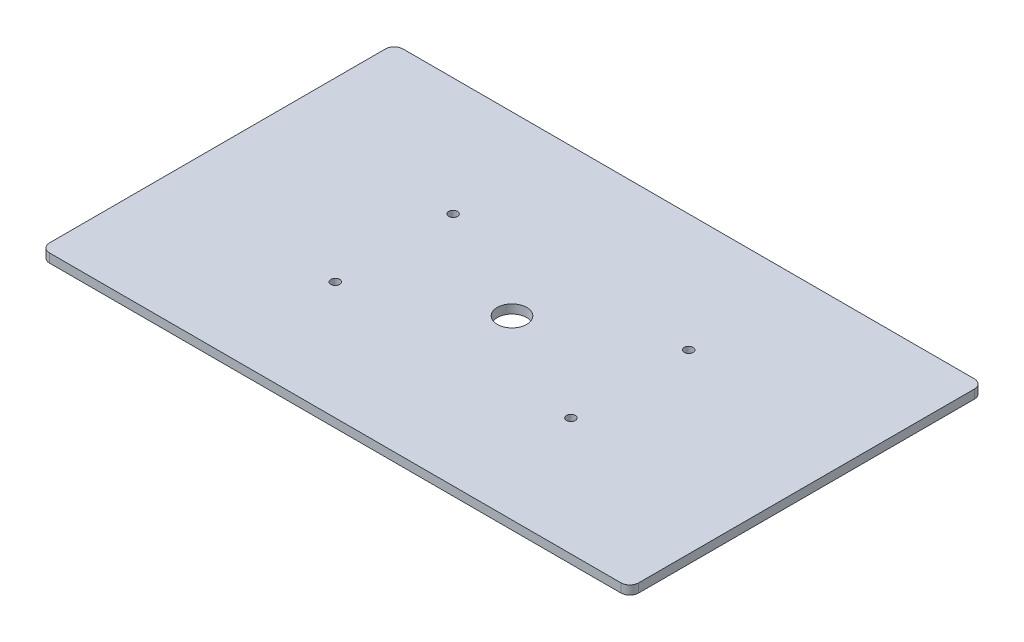
ISO-10303-21;
HEADER;
FILE_DESCRIPTION(('STEP AP214'),'2;1');
FILE_NAME('part.step','',(''),(''),'','','');
FILE_SCHEMA(('AUTOMOTIVE_DESIGN { 1 0 10303 214 1 1 1 1 }'));
ENDSEC;
DATA;
#1=APPLICATION_CONTEXT('core data for automotive mechanical design processes');
#2=APPLICATION_PROTOCOL_DEFINITION('international standard','automotive_design',2000,#1);
#3=PRODUCT_CONTEXT('',#1,'mechanical');
#4=PRODUCT('Part','Part','',(#3));
#5=PRODUCT_RELATED_PRODUCT_CATEGORY('part','',(#4));
#6=PRODUCT_DEFINITION_FORMATION('','',#4);
#7=PRODUCT_DEFINITION_CONTEXT('part definition',#1,'design');
#8=PRODUCT_DEFINITION('design','',#6,#7);
#9=PRODUCT_DEFINITION_SHAPE('','',#8);
#10=(LENGTH_UNIT() NAMED_UNIT(*) SI_UNIT(.MILLI.,.METRE.));
#11=(NAMED_UNIT(*) PLANE_ANGLE_UNIT() SI_UNIT($,.RADIAN.));
#12=(NAMED_UNIT(*) SI_UNIT($,.STERADIAN.) SOLID_ANGLE_UNIT());
#13=UNCERTAINTY_MEASURE_WITH_UNIT(LENGTH_MEASURE(1.E-05),#10,'distance_accuracy_value','');
#14=(GEOMETRIC_REPRESENTATION_CONTEXT(3) GLOBAL_UNCERTAINTY_ASSIGNED_CONTEXT((#13)) GLOBAL_UNIT_ASSIGNED_CONTEXT((#10,
#11,#12)) REPRESENTATION_CONTEXT('',''));
#15=CARTESIAN_POINT('',(0.,0.,0.));
#16=DIRECTION('',(0.,0.,1.));
#17=DIRECTION('',(1.,0.,0.));
#18=AXIS2_PLACEMENT_3D('',#15,#16,#17);
#19=CARTESIAN_POINT('',(100.,3.,-60.));
#20=DIRECTION('',(-1.,0.,0.));
#21=DIRECTION('',(0.,0.,1.));
#22=AXIS2_PLACEMENT_3D('',#19,#20,#21);
#23=PLANE('',#22);
#24=DIRECTION('',(0.,0.,-1.));
#25=VECTOR('',#24,1.);
#26=CARTESIAN_POINT('',(100.,0.,-60.));
#27=LINE('',#26,#25);
#28=CARTESIAN_POINT('',(100.,0.,57.));
#29=VERTEX_POINT('',#28);
#30=CARTESIAN_POINT('',(100.,0.,-57.));
#31=VERTEX_POINT('',#30);
#32=EDGE_CURVE('E144',#29,#31,#27,.T.);
#33=ORIENTED_EDGE('',*,*,#32,.T.);
#34=DIRECTION('',(0.,-1.,0.));
#35=VECTOR('',#34,1.);
#36=CARTESIAN_POINT('',(100.,3.,-57.));
#37=LINE('',#36,#35);
#38=CARTESIAN_POINT('',(100.,3.,-57.));
#39=VERTEX_POINT('',#38);
#40=EDGE_CURVE('E11',#31,#39,#37,.F.);
#41=ORIENTED_EDGE('',*,*,#40,.T.);
#42=DIRECTION('',(0.,0.,-1.));
#43=VECTOR('',#42,1.);
#44=CARTESIAN_POINT('',(100.,3.,-60.));
#45=LINE('',#44,#43);
#46=CARTESIAN_POINT('',(100.,3.,57.));
#47=VERTEX_POINT('',#46);
#48=EDGE_CURVE('E142',#47,#39,#45,.T.);
#49=ORIENTED_EDGE('',*,*,#48,.F.);
#50=DIRECTION('',(0.,-1.,0.));
#51=VECTOR('',#50,1.);
#52=CARTESIAN_POINT('',(100.,3.,57.));
#53=LINE('',#52,#51);
#54=EDGE_CURVE('E51',#47,#29,#53,.T.);
#55=ORIENTED_EDGE('',*,*,#54,.T.);
#56=EDGE_LOOP('',(#33,#41,#49,#55));
#57=FACE_BOUND('',#56,.T.);
#58=ADVANCED_FACE('F42',(#57),#23,.F.);
#59=CARTESIAN_POINT('',(-100.,3.,-60.));
#60=DIRECTION('',(0.,0.,1.));
#61=DIRECTION('',(1.,0.,0.));
#62=AXIS2_PLACEMENT_3D('',#59,#60,#61);
#63=PLANE('',#62);
#64=DIRECTION('',(-1.,0.,0.));
#65=VECTOR('',#64,1.);
#66=CARTESIAN_POINT('',(-100.,0.,-60.));
#67=LINE('',#66,#65);
#68=CARTESIAN_POINT('',(97.,0.,-60.));
#69=VERTEX_POINT('',#68);
#70=CARTESIAN_POINT('',(-97.,0.,-60.));
#71=VERTEX_POINT('',#70);
#72=EDGE_CURVE('E138',#69,#71,#67,.T.);
#73=ORIENTED_EDGE('',*,*,#72,.T.);
#74=DIRECTION('',(0.,-1.,0.));
#75=VECTOR('',#74,1.);
#76=CARTESIAN_POINT('',(-97.,3.,-60.));
#77=LINE('',#76,#75);
#78=CARTESIAN_POINT('',(-97.,3.,-60.));
#79=VERTEX_POINT('',#78);
#80=EDGE_CURVE('E114',#71,#79,#77,.F.);
#81=ORIENTED_EDGE('',*,*,#80,.T.);
#82=DIRECTION('',(-1.,0.,0.));
#83=VECTOR('',#82,1.);
#84=CARTESIAN_POINT('',(-100.,3.,-60.));
#85=LINE('',#84,#83);
#86=CARTESIAN_POINT('',(97.,3.,-60.));
#87=VERTEX_POINT('',#86);
#88=EDGE_CURVE('E201',#87,#79,#85,.T.);
#89=ORIENTED_EDGE('',*,*,#88,.F.);
#90=DIRECTION('',(0.,-1.,0.));
#91=VECTOR('',#90,1.);
#92=CARTESIAN_POINT('',(97.,3.,-60.));
#93=LINE('',#92,#91);
#94=EDGE_CURVE('E120',#87,#69,#93,.T.);
#95=ORIENTED_EDGE('',*,*,#94,.T.);
#96=EDGE_LOOP('',(#73,#81,#89,#95));
#97=FACE_BOUND('',#96,.T.);
#98=ADVANCED_FACE('F268',(#97),#63,.F.);
#99=CARTESIAN_POINT('',(-100.,3.,-60.));
#100=DIRECTION('',(1.,0.,0.));
#101=DIRECTION('',(0.,0.,-1.));
#102=AXIS2_PLACEMENT_3D('',#99,#100,#101);
#103=PLANE('',#102);
#104=DIRECTION('',(0.,0.,1.));
#105=VECTOR('',#104,1.);
#106=CARTESIAN_POINT('',(-100.,3.,-60.));
#107=LINE('',#106,#105);
#108=CARTESIAN_POINT('',(-100.,3.,-57.));
#109=VERTEX_POINT('',#108);
#110=CARTESIAN_POINT('',(-100.,3.,57.));
#111=VERTEX_POINT('',#110);
#112=EDGE_CURVE('E129',#109,#111,#107,.T.);
#113=ORIENTED_EDGE('',*,*,#112,.F.);
#114=DIRECTION('',(0.,-1.,0.));
#115=VECTOR('',#114,1.);
#116=CARTESIAN_POINT('',(-100.,3.,-57.));
#117=LINE('',#116,#115);
#118=CARTESIAN_POINT('',(-100.,0.,-57.));
#119=VERTEX_POINT('',#118);
#120=EDGE_CURVE('E113',#109,#119,#117,.T.);
#121=ORIENTED_EDGE('',*,*,#120,.T.);
#122=DIRECTION('',(0.,0.,1.));
#123=VECTOR('',#122,1.);
#124=CARTESIAN_POINT('',(-100.,0.,-60.));
#125=LINE('',#124,#123);
#126=CARTESIAN_POINT('',(-100.,0.,57.));
#127=VERTEX_POINT('',#126);
#128=EDGE_CURVE('E127',#119,#127,#125,.T.);
#129=ORIENTED_EDGE('',*,*,#128,.T.);
#130=DIRECTION('',(0.,-1.,0.));
#131=VECTOR('',#130,1.);
#132=CARTESIAN_POINT('',(-100.,3.,57.));
#133=LINE('',#132,#131);
#134=EDGE_CURVE('E132',#127,#111,#133,.F.);
#135=ORIENTED_EDGE('',*,*,#134,.T.);
#136=EDGE_LOOP('',(#113,#121,#129,#135));
#137=FACE_BOUND('',#136,.T.);
#138=ADVANCED_FACE('F126',(#137),#103,.F.);
#139=CARTESIAN_POINT('',(-100.,3.,60.));
#140=DIRECTION('',(0.,0.,-1.));
#141=DIRECTION('',(-1.,0.,0.));
#142=AXIS2_PLACEMENT_3D('',#139,#140,#141);
#143=PLANE('',#142);
#144=DIRECTION('',(1.,0.,0.));
#145=VECTOR('',#144,1.);
#146=CARTESIAN_POINT('',(-100.,3.,60.));
#147=LINE('',#146,#145);
#148=CARTESIAN_POINT('',(-97.,3.,60.));
#149=VERTEX_POINT('',#148);
#150=CARTESIAN_POINT('',(97.,3.,60.));
#151=VERTEX_POINT('',#150);
#152=EDGE_CURVE('E149',#149,#151,#147,.T.);
#153=ORIENTED_EDGE('',*,*,#152,.F.);
#154=DIRECTION('',(0.,-1.,0.));
#155=VECTOR('',#154,1.);
#156=CARTESIAN_POINT('',(-97.,3.,60.));
#157=LINE('',#156,#155);
#158=CARTESIAN_POINT('',(-97.,0.,60.));
#159=VERTEX_POINT('',#158);
#160=EDGE_CURVE('E176',#149,#159,#157,.T.);
#161=ORIENTED_EDGE('',*,*,#160,.T.);
#162=DIRECTION('',(1.,0.,0.));
#163=VECTOR('',#162,1.);
#164=CARTESIAN_POINT('',(-100.,0.,60.));
#165=LINE('',#164,#163);
#166=CARTESIAN_POINT('',(97.,0.,60.));
#167=VERTEX_POINT('',#166);
#168=EDGE_CURVE('E137',#159,#167,#165,.T.);
#169=ORIENTED_EDGE('',*,*,#168,.T.);
#170=DIRECTION('',(0.,-1.,0.));
#171=VECTOR('',#170,1.);
#172=CARTESIAN_POINT('',(97.,3.,60.));
#173=LINE('',#172,#171);
#174=EDGE_CURVE('E58',#167,#151,#173,.F.);
#175=ORIENTED_EDGE('',*,*,#174,.T.);
#176=EDGE_LOOP('',(#153,#161,#169,#175));
#177=FACE_BOUND('',#176,.T.);
#178=ADVANCED_FACE('F255',(#177),#143,.F.);
#179=CARTESIAN_POINT('',(0.,3.,0.));
#180=DIRECTION('',(0.,1.,0.));
#181=DIRECTION('',(0.,0.,1.));
#182=AXIS2_PLACEMENT_3D('',#179,#180,#181);
#183=PLANE('',#182);
#184=CARTESIAN_POINT('',(0.,3.,0.));
#185=DIRECTION('',(0.,1.,0.));
#186=DIRECTION('',(0.,0.,1.));
#187=AXIS2_PLACEMENT_3D('',#184,#185,#186);
#188=CIRCLE('',#187,5.);
#189=CARTESIAN_POINT('',(0.,3.,5.));
#190=VERTEX_POINT('',#189);
#191=EDGE_CURVE('E235',#190,#190,#188,.T.);
#192=ORIENTED_EDGE('',*,*,#191,.F.);
#193=EDGE_LOOP('',(#192));
#194=FACE_BOUND('',#193,.T.);
#195=CARTESIAN_POINT('',(-40.,3.,-20.));
#196=DIRECTION('',(0.,-1.,0.));
#197=DIRECTION('',(0.,0.,1.));
#198=AXIS2_PLACEMENT_3D('',#195,#196,#197);
#199=CIRCLE('',#198,1.5);
#200=CARTESIAN_POINT('',(-40.,3.,-18.5));
#201=VERTEX_POINT('',#200);
#202=EDGE_CURVE('E227',#201,#201,#199,.T.);
#203=ORIENTED_EDGE('',*,*,#202,.T.);
#204=EDGE_LOOP('',(#203));
#205=FACE_BOUND('',#204,.T.);
#206=CARTESIAN_POINT('',(-40.,3.,20.));
#207=DIRECTION('',(0.,1.,0.));
#208=DIRECTION('',(0.,0.,-1.));
#209=AXIS2_PLACEMENT_3D('',#206,#207,#208);
#210=CIRCLE('',#209,1.5);
#211=CARTESIAN_POINT('',(-40.,3.,18.5));
#212=VERTEX_POINT('',#211);
#213=EDGE_CURVE('E219',#212,#212,#210,.T.);
#214=ORIENTED_EDGE('',*,*,#213,.F.);
#215=EDGE_LOOP('',(#214));
#216=FACE_BOUND('',#215,.T.);
#217=CARTESIAN_POINT('',(40.,3.,20.));
#218=DIRECTION('',(0.,-1.,0.));
#219=DIRECTION('',(0.,0.,-1.));
#220=AXIS2_PLACEMENT_3D('',#217,#218,#219);
#221=CIRCLE('',#220,1.5);
#222=CARTESIAN_POINT('',(40.,3.,18.5));
#223=VERTEX_POINT('',#222);
#224=EDGE_CURVE('E211',#223,#223,#221,.T.);
#225=ORIENTED_EDGE('',*,*,#224,.T.);
#226=EDGE_LOOP('',(#225));
#227=FACE_BOUND('',#226,.T.);
#228=CARTESIAN_POINT('',(40.,3.,-20.));
#229=DIRECTION('',(0.,1.,0.));
#230=DIRECTION('',(0.,0.,1.));
#231=AXIS2_PLACEMENT_3D('',#228,#229,#230);
#232=CIRCLE('',#231,1.5);
#233=CARTESIAN_POINT('',(40.,3.,-18.5));
#234=VERTEX_POINT('',#233);
#235=EDGE_CURVE('E194',#234,#234,#232,.T.);
#236=ORIENTED_EDGE('',*,*,#235,.F.);
#237=EDGE_LOOP('',(#236));
#238=FACE_BOUND('',#237,.T.);
#239=ORIENTED_EDGE('',*,*,#88,.T.);
#240=CARTESIAN_POINT('',(-97.,3.,-57.));
#241=DIRECTION('',(0.,1.,0.));
#242=DIRECTION('',(0.,0.,1.));
#243=AXIS2_PLACEMENT_3D('',#240,#241,#242);
#244=CIRCLE('',#243,3.);
#245=EDGE_CURVE('E171',#79,#109,#244,.T.);
#246=ORIENTED_EDGE('',*,*,#245,.T.);
#247=ORIENTED_EDGE('',*,*,#112,.T.);
#248=CARTESIAN_POINT('',(-97.,3.,57.));
#249=DIRECTION('',(0.,1.,0.));
#250=DIRECTION('',(0.,0.,1.));
#251=AXIS2_PLACEMENT_3D('',#248,#249,#250);
#252=CIRCLE('',#251,3.);
#253=EDGE_CURVE('E65',#111,#149,#252,.T.);
#254=ORIENTED_EDGE('',*,*,#253,.T.);
#255=ORIENTED_EDGE('',*,*,#152,.T.);
#256=CARTESIAN_POINT('',(97.,3.,57.));
#257=DIRECTION('',(0.,1.,0.));
#258=DIRECTION('',(0.,0.,1.));
#259=AXIS2_PLACEMENT_3D('',#256,#257,#258);
#260=CIRCLE('',#259,3.);
#261=EDGE_CURVE('E163',#151,#47,#260,.T.);
#262=ORIENTED_EDGE('',*,*,#261,.T.);
#263=ORIENTED_EDGE('',*,*,#48,.T.);
#264=CARTESIAN_POINT('',(97.,3.,-57.));
#265=DIRECTION('',(0.,1.,0.));
#266=DIRECTION('',(0.,0.,1.));
#267=AXIS2_PLACEMENT_3D('',#264,#265,#266);
#268=CIRCLE('',#267,3.);
#269=EDGE_CURVE('E166',#39,#87,#268,.T.);
#270=ORIENTED_EDGE('',*,*,#269,.T.);
#271=EDGE_LOOP('',(#239,#246,#247,#254,#255,#262,#263,#270));
#272=FACE_BOUND('',#271,.T.);
#273=ADVANCED_FACE('F252',(#194,#205,#216,#227,#238,#272),#183,.T.);
#274=CARTESIAN_POINT('',(0.,0.,0.));
#275=DIRECTION('',(0.,1.,0.));
#276=DIRECTION('',(0.,0.,1.));
#277=AXIS2_PLACEMENT_3D('',#274,#275,#276);
#278=PLANE('',#277);
#279=CARTESIAN_POINT('',(0.,0.,0.));
#280=DIRECTION('',(0.,1.,0.));
#281=DIRECTION('',(0.,0.,1.));
#282=AXIS2_PLACEMENT_3D('',#279,#280,#281);
#283=CIRCLE('',#282,5.);
#284=CARTESIAN_POINT('',(0.,0.,5.));
#285=VERTEX_POINT('',#284);
#286=EDGE_CURVE('E231',#285,#285,#283,.T.);
#287=ORIENTED_EDGE('',*,*,#286,.T.);
#288=EDGE_LOOP('',(#287));
#289=FACE_BOUND('',#288,.T.);
#290=CARTESIAN_POINT('',(-40.,0.,-20.));
#291=DIRECTION('',(0.,-1.,0.));
#292=DIRECTION('',(0.,0.,1.));
#293=AXIS2_PLACEMENT_3D('',#290,#291,#292);
#294=CIRCLE('',#293,1.5);
#295=CARTESIAN_POINT('',(-40.,0.,-18.5));
#296=VERTEX_POINT('',#295);
#297=EDGE_CURVE('E223',#296,#296,#294,.T.);
#298=ORIENTED_EDGE('',*,*,#297,.F.);
#299=EDGE_LOOP('',(#298));
#300=FACE_BOUND('',#299,.T.);
#301=CARTESIAN_POINT('',(-40.,0.,20.));
#302=DIRECTION('',(0.,1.,0.));
#303=DIRECTION('',(0.,0.,-1.));
#304=AXIS2_PLACEMENT_3D('',#301,#302,#303);
#305=CIRCLE('',#304,1.5);
#306=CARTESIAN_POINT('',(-40.,0.,18.5));
#307=VERTEX_POINT('',#306);
#308=EDGE_CURVE('E215',#307,#307,#305,.T.);
#309=ORIENTED_EDGE('',*,*,#308,.T.);
#310=EDGE_LOOP('',(#309));
#311=FACE_BOUND('',#310,.T.);
#312=CARTESIAN_POINT('',(40.,0.,20.));
#313=DIRECTION('',(0.,-1.,0.));
#314=DIRECTION('',(0.,0.,-1.));
#315=AXIS2_PLACEMENT_3D('',#312,#313,#314);
#316=CIRCLE('',#315,1.5);
#317=CARTESIAN_POINT('',(40.,0.,18.5));
#318=VERTEX_POINT('',#317);
#319=EDGE_CURVE('E209',#318,#318,#316,.T.);
#320=ORIENTED_EDGE('',*,*,#319,.F.);
#321=EDGE_LOOP('',(#320));
#322=FACE_BOUND('',#321,.T.);
#323=CARTESIAN_POINT('',(40.,0.,-20.));
#324=DIRECTION('',(0.,1.,0.));
#325=DIRECTION('',(0.,0.,1.));
#326=AXIS2_PLACEMENT_3D('',#323,#324,#325);
#327=CIRCLE('',#326,1.5);
#328=CARTESIAN_POINT('',(40.,0.,-18.5));
#329=VERTEX_POINT('',#328);
#330=EDGE_CURVE('E191',#329,#329,#327,.T.);
#331=ORIENTED_EDGE('',*,*,#330,.T.);
#332=EDGE_LOOP('',(#331));
#333=FACE_BOUND('',#332,.T.);
#334=ORIENTED_EDGE('',*,*,#128,.F.);
#335=CARTESIAN_POINT('',(-97.,0.,-57.));
#336=DIRECTION('',(0.,1.,0.));
#337=DIRECTION('',(0.,0.,1.));
#338=AXIS2_PLACEMENT_3D('',#335,#336,#337);
#339=CIRCLE('',#338,3.);
#340=EDGE_CURVE('E109',#119,#71,#339,.F.);
#341=ORIENTED_EDGE('',*,*,#340,.T.);
#342=ORIENTED_EDGE('',*,*,#72,.F.);
#343=CARTESIAN_POINT('',(97.,0.,-57.));
#344=DIRECTION('',(0.,1.,0.));
#345=DIRECTION('',(0.,0.,1.));
#346=AXIS2_PLACEMENT_3D('',#343,#344,#345);
#347=CIRCLE('',#346,3.);
#348=EDGE_CURVE('E153',#69,#31,#347,.F.);
#349=ORIENTED_EDGE('',*,*,#348,.T.);
#350=ORIENTED_EDGE('',*,*,#32,.F.);
#351=CARTESIAN_POINT('',(97.,0.,57.));
#352=DIRECTION('',(0.,1.,0.));
#353=DIRECTION('',(0.,0.,1.));
#354=AXIS2_PLACEMENT_3D('',#351,#352,#353);
#355=CIRCLE('',#354,3.);
#356=EDGE_CURVE('E131',#29,#167,#355,.F.);
#357=ORIENTED_EDGE('',*,*,#356,.T.);
#358=ORIENTED_EDGE('',*,*,#168,.F.);
#359=CARTESIAN_POINT('',(-97.,0.,57.));
#360=DIRECTION('',(0.,1.,0.));
#361=DIRECTION('',(0.,0.,1.));
#362=AXIS2_PLACEMENT_3D('',#359,#360,#361);
#363=CIRCLE('',#362,3.);
#364=EDGE_CURVE('E121',#159,#127,#363,.F.);
#365=ORIENTED_EDGE('',*,*,#364,.T.);
#366=EDGE_LOOP('',(#334,#341,#342,#349,#350,#357,#358,#365));
#367=FACE_BOUND('',#366,.T.);
#368=ADVANCED_FACE('F134',(#289,#300,#311,#322,#333,#367),#278,.F.);
#369=CARTESIAN_POINT('',(-97.,3.,-57.));
#370=DIRECTION('',(0.,-1.,0.));
#371=DIRECTION('',(0.,0.,-1.));
#372=AXIS2_PLACEMENT_3D('',#369,#370,#371);
#373=CYLINDRICAL_SURFACE('',#372,3.);
#374=ORIENTED_EDGE('',*,*,#245,.F.);
#375=ORIENTED_EDGE('',*,*,#80,.F.);
#376=ORIENTED_EDGE('',*,*,#340,.F.);
#377=ORIENTED_EDGE('',*,*,#120,.F.);
#378=EDGE_LOOP('',(#374,#375,#376,#377));
#379=FACE_BOUND('',#378,.T.);
#380=ADVANCED_FACE('F112',(#379),#373,.T.);
#381=CARTESIAN_POINT('',(-97.,3.,57.));
#382=DIRECTION('',(0.,-1.,0.));
#383=DIRECTION('',(0.,0.,-1.));
#384=AXIS2_PLACEMENT_3D('',#381,#382,#383);
#385=CYLINDRICAL_SURFACE('',#384,3.);
#386=ORIENTED_EDGE('',*,*,#253,.F.);
#387=ORIENTED_EDGE('',*,*,#134,.F.);
#388=ORIENTED_EDGE('',*,*,#364,.F.);
#389=ORIENTED_EDGE('',*,*,#160,.F.);
#390=EDGE_LOOP('',(#386,#387,#388,#389));
#391=FACE_BOUND('',#390,.T.);
#392=ADVANCED_FACE('F280',(#391),#385,.T.);
#393=CARTESIAN_POINT('',(97.,3.,-57.));
#394=DIRECTION('',(0.,-1.,0.));
#395=DIRECTION('',(0.,0.,-1.));
#396=AXIS2_PLACEMENT_3D('',#393,#394,#395);
#397=CYLINDRICAL_SURFACE('',#396,3.);
#398=ORIENTED_EDGE('',*,*,#269,.F.);
#399=ORIENTED_EDGE('',*,*,#40,.F.);
#400=ORIENTED_EDGE('',*,*,#348,.F.);
#401=ORIENTED_EDGE('',*,*,#94,.F.);
#402=EDGE_LOOP('',(#398,#399,#400,#401));
#403=FACE_BOUND('',#402,.T.);
#404=ADVANCED_FACE('F270',(#403),#397,.T.);
#405=CARTESIAN_POINT('',(97.,3.,57.));
#406=DIRECTION('',(0.,-1.,0.));
#407=DIRECTION('',(0.,0.,-1.));
#408=AXIS2_PLACEMENT_3D('',#405,#406,#407);
#409=CYLINDRICAL_SURFACE('',#408,3.);
#410=ORIENTED_EDGE('',*,*,#261,.F.);
#411=ORIENTED_EDGE('',*,*,#174,.F.);
#412=ORIENTED_EDGE('',*,*,#356,.F.);
#413=ORIENTED_EDGE('',*,*,#54,.F.);
#414=EDGE_LOOP('',(#410,#411,#412,#413));
#415=FACE_BOUND('',#414,.T.);
#416=ADVANCED_FACE('F44',(#415),#409,.T.);
#417=CARTESIAN_POINT('',(40.,0.,-20.));
#418=DIRECTION('',(0.,1.,0.));
#419=DIRECTION('',(0.,0.,1.));
#420=AXIS2_PLACEMENT_3D('',#417,#418,#419);
#421=CYLINDRICAL_SURFACE('',#420,1.5);
#422=ORIENTED_EDGE('',*,*,#330,.F.);
#423=EDGE_LOOP('',(#422));
#424=FACE_BOUND('',#423,.T.);
#425=ORIENTED_EDGE('',*,*,#235,.T.);
#426=EDGE_LOOP('',(#425));
#427=FACE_BOUND('',#426,.T.);
#428=ADVANCED_FACE('F272',(#424,#427),#421,.F.);
#429=CARTESIAN_POINT('',(40.,0.,20.));
#430=DIRECTION('',(0.,1.,0.));
#431=DIRECTION('',(0.,0.,1.));
#432=AXIS2_PLACEMENT_3D('',#429,#430,#431);
#433=CYLINDRICAL_SURFACE('',#432,1.5);
#434=ORIENTED_EDGE('',*,*,#319,.T.);
#435=EDGE_LOOP('',(#434));
#436=FACE_BOUND('',#435,.T.);
#437=ORIENTED_EDGE('',*,*,#224,.F.);
#438=EDGE_LOOP('',(#437));
#439=FACE_BOUND('',#438,.T.);
#440=ADVANCED_FACE('F277',(#436,#439),#433,.F.);
#441=CARTESIAN_POINT('',(-40.,0.,20.));
#442=DIRECTION('',(0.,1.,0.));
#443=DIRECTION('',(0.,0.,1.));
#444=AXIS2_PLACEMENT_3D('',#441,#442,#443);
#445=CYLINDRICAL_SURFACE('',#444,1.5);
#446=ORIENTED_EDGE('',*,*,#308,.F.);
#447=EDGE_LOOP('',(#446));
#448=FACE_BOUND('',#447,.T.);
#449=ORIENTED_EDGE('',*,*,#213,.T.);
#450=EDGE_LOOP('',(#449));
#451=FACE_BOUND('',#450,.T.);
#452=ADVANCED_FACE('F306',(#448,#451),#445,.F.);
#453=CARTESIAN_POINT('',(-40.,0.,-20.));
#454=DIRECTION('',(0.,1.,0.));
#455=DIRECTION('',(0.,0.,1.));
#456=AXIS2_PLACEMENT_3D('',#453,#454,#455);
#457=CYLINDRICAL_SURFACE('',#456,1.5);
#458=ORIENTED_EDGE('',*,*,#297,.T.);
#459=EDGE_LOOP('',(#458));
#460=FACE_BOUND('',#459,.T.);
#461=ORIENTED_EDGE('',*,*,#202,.F.);
#462=EDGE_LOOP('',(#461));
#463=FACE_BOUND('',#462,.T.);
#464=ADVANCED_FACE('F248',(#460,#463),#457,.F.);
#465=CARTESIAN_POINT('',(0.,0.,0.));
#466=DIRECTION('',(0.,1.,0.));
#467=DIRECTION('',(0.,0.,1.));
#468=AXIS2_PLACEMENT_3D('',#465,#466,#467);
#469=CYLINDRICAL_SURFACE('',#468,5.);
#470=ORIENTED_EDGE('',*,*,#286,.F.);
#471=EDGE_LOOP('',(#470));
#472=FACE_BOUND('',#471,.T.);
#473=ORIENTED_EDGE('',*,*,#191,.T.);
#474=EDGE_LOOP('',(#473));
#475=FACE_BOUND('',#474,.T.);
#476=ADVANCED_FACE('F245',(#472,#475),#469,.F.);
#477=CLOSED_SHELL('',(#58,#98,#138,#178,#273,#368,#380,#392,#404,#416,#428,#440,#452,#464,#476));
#478=MANIFOLD_SOLID_BREP('B2',#477);
#479=ADVANCED_BREP_SHAPE_REPRESENTATION('',(#18,#478),#14);
#480=SHAPE_DEFINITION_REPRESENTATION(#9,#479);
ENDSEC;
END-ISO-10303-21;
